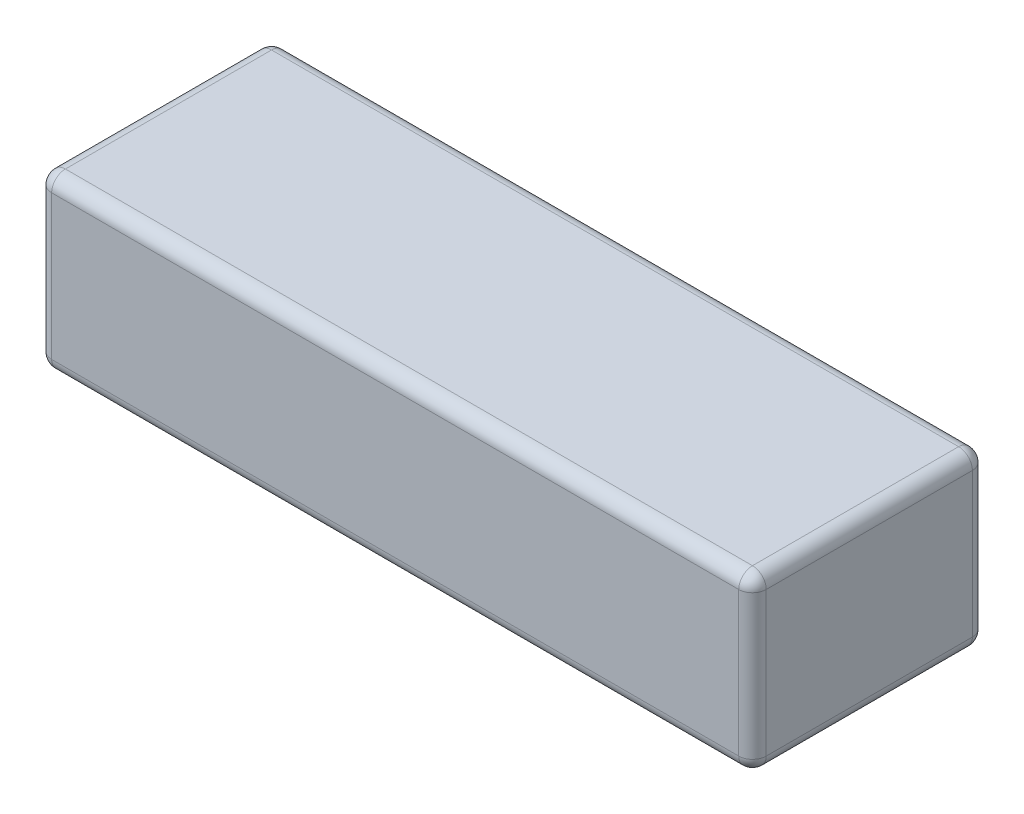
ISO-10303-21;
HEADER;
FILE_DESCRIPTION(('STEP AP214'),'2;1');
FILE_NAME('part.step','',(''),(''),'','','');
FILE_SCHEMA(('AUTOMOTIVE_DESIGN { 1 0 10303 214 1 1 1 1 }'));
ENDSEC;
DATA;
#1=APPLICATION_CONTEXT('core data for automotive mechanical design processes');
#2=APPLICATION_PROTOCOL_DEFINITION('international standard','automotive_design',2000,#1);
#3=PRODUCT_CONTEXT('',#1,'mechanical');
#4=PRODUCT('Part','Part','',(#3));
#5=PRODUCT_RELATED_PRODUCT_CATEGORY('part','',(#4));
#6=PRODUCT_DEFINITION_FORMATION('','',#4);
#7=PRODUCT_DEFINITION_CONTEXT('part definition',#1,'design');
#8=PRODUCT_DEFINITION('design','',#6,#7);
#9=PRODUCT_DEFINITION_SHAPE('','',#8);
#10=(LENGTH_UNIT() NAMED_UNIT(*) SI_UNIT(.MILLI.,.METRE.));
#11=(NAMED_UNIT(*) PLANE_ANGLE_UNIT() SI_UNIT($,.RADIAN.));
#12=(NAMED_UNIT(*) SI_UNIT($,.STERADIAN.) SOLID_ANGLE_UNIT());
#13=UNCERTAINTY_MEASURE_WITH_UNIT(LENGTH_MEASURE(1.E-05),#10,'distance_accuracy_value','');
#14=(GEOMETRIC_REPRESENTATION_CONTEXT(3) GLOBAL_UNCERTAINTY_ASSIGNED_CONTEXT((#13)) GLOBAL_UNIT_ASSIGNED_CONTEXT((#10,
#11,#12)) REPRESENTATION_CONTEXT('',''));
#15=CARTESIAN_POINT('',(0.,0.,0.));
#16=DIRECTION('',(0.,0.,1.));
#17=DIRECTION('',(1.,0.,0.));
#18=AXIS2_PLACEMENT_3D('',#15,#16,#17);
#19=CARTESIAN_POINT('',(52.,25.,17.));
#20=DIRECTION('',(-1.,0.,0.));
#21=DIRECTION('',(0.,0.,1.));
#22=AXIS2_PLACEMENT_3D('',#19,#20,#21);
#23=PLANE('',#22);
#24=DIRECTION('',(0.,-1.,0.));
#25=VECTOR('',#24,1.);
#26=CARTESIAN_POINT('',(52.,25.,-15.));
#27=LINE('',#26,#25);
#28=CARTESIAN_POINT('',(52.,2.,-15.));
#29=VERTEX_POINT('',#28);
#30=CARTESIAN_POINT('',(52.,23.,-15.));
#31=VERTEX_POINT('',#30);
#32=EDGE_CURVE('E132',#29,#31,#27,.F.);
#33=ORIENTED_EDGE('',*,*,#32,.T.);
#34=DIRECTION('',(0.,0.,-1.));
#35=VECTOR('',#34,1.);
#36=CARTESIAN_POINT('',(52.,23.,17.));
#37=LINE('',#36,#35);
#38=CARTESIAN_POINT('',(52.,23.,15.));
#39=VERTEX_POINT('',#38);
#40=EDGE_CURVE('E169',#31,#39,#37,.F.);
#41=ORIENTED_EDGE('',*,*,#40,.T.);
#42=DIRECTION('',(0.,-1.,0.));
#43=VECTOR('',#42,1.);
#44=CARTESIAN_POINT('',(52.,25.,15.));
#45=LINE('',#44,#43);
#46=CARTESIAN_POINT('',(52.,2.,15.));
#47=VERTEX_POINT('',#46);
#48=EDGE_CURVE('E166',#39,#47,#45,.T.);
#49=ORIENTED_EDGE('',*,*,#48,.T.);
#50=DIRECTION('',(0.,0.,-1.));
#51=VECTOR('',#50,1.);
#52=CARTESIAN_POINT('',(52.,2.,-17.));
#53=LINE('',#52,#51);
#54=EDGE_CURVE('E161',#47,#29,#53,.T.);
#55=ORIENTED_EDGE('',*,*,#54,.T.);
#56=EDGE_LOOP('',(#33,#41,#49,#55));
#57=FACE_BOUND('',#56,.T.);
#58=ADVANCED_FACE('F37',(#57),#23,.F.);
#59=CARTESIAN_POINT('',(-52.,25.,-17.));
#60=DIRECTION('',(0.,0.,1.));
#61=DIRECTION('',(1.,0.,0.));
#62=AXIS2_PLACEMENT_3D('',#59,#60,#61);
#63=PLANE('',#62);
#64=DIRECTION('',(0.,-1.,0.));
#65=VECTOR('',#64,1.);
#66=CARTESIAN_POINT('',(-50.,25.,-17.));
#67=LINE('',#66,#65);
#68=CARTESIAN_POINT('',(-50.,2.,-17.));
#69=VERTEX_POINT('',#68);
#70=CARTESIAN_POINT('',(-50.,23.,-17.));
#71=VERTEX_POINT('',#70);
#72=EDGE_CURVE('E154',#69,#71,#67,.F.);
#73=ORIENTED_EDGE('',*,*,#72,.T.);
#74=DIRECTION('',(-1.,0.,0.));
#75=VECTOR('',#74,1.);
#76=CARTESIAN_POINT('',(-52.,23.,-17.));
#77=LINE('',#76,#75);
#78=CARTESIAN_POINT('',(50.,23.,-17.));
#79=VERTEX_POINT('',#78);
#80=EDGE_CURVE('E158',#71,#79,#77,.F.);
#81=ORIENTED_EDGE('',*,*,#80,.T.);
#82=DIRECTION('',(0.,-1.,0.));
#83=VECTOR('',#82,1.);
#84=CARTESIAN_POINT('',(50.,25.,-17.));
#85=LINE('',#84,#83);
#86=CARTESIAN_POINT('',(50.,2.,-17.));
#87=VERTEX_POINT('',#86);
#88=EDGE_CURVE('E130',#79,#87,#85,.T.);
#89=ORIENTED_EDGE('',*,*,#88,.T.);
#90=DIRECTION('',(-1.,0.,0.));
#91=VECTOR('',#90,1.);
#92=CARTESIAN_POINT('',(-52.,2.,-17.));
#93=LINE('',#92,#91);
#94=EDGE_CURVE('E148',#87,#69,#93,.T.);
#95=ORIENTED_EDGE('',*,*,#94,.T.);
#96=EDGE_LOOP('',(#73,#81,#89,#95));
#97=FACE_BOUND('',#96,.T.);
#98=ADVANCED_FACE('F156',(#97),#63,.F.);
#99=CARTESIAN_POINT('',(-52.,25.,17.));
#100=DIRECTION('',(1.,0.,0.));
#101=DIRECTION('',(0.,0.,-1.));
#102=AXIS2_PLACEMENT_3D('',#99,#100,#101);
#103=PLANE('',#102);
#104=DIRECTION('',(0.,-1.,0.));
#105=VECTOR('',#104,1.);
#106=CARTESIAN_POINT('',(-52.,25.,15.));
#107=LINE('',#106,#105);
#108=CARTESIAN_POINT('',(-52.,2.,15.));
#109=VERTEX_POINT('',#108);
#110=CARTESIAN_POINT('',(-52.,23.,15.));
#111=VERTEX_POINT('',#110);
#112=EDGE_CURVE('E173',#109,#111,#107,.F.);
#113=ORIENTED_EDGE('',*,*,#112,.T.);
#114=DIRECTION('',(0.,0.,1.));
#115=VECTOR('',#114,1.);
#116=CARTESIAN_POINT('',(-52.,23.,17.));
#117=LINE('',#116,#115);
#118=CARTESIAN_POINT('',(-52.,23.,-15.));
#119=VERTEX_POINT('',#118);
#120=EDGE_CURVE('E178',#111,#119,#117,.F.);
#121=ORIENTED_EDGE('',*,*,#120,.T.);
#122=DIRECTION('',(0.,-1.,0.));
#123=VECTOR('',#122,1.);
#124=CARTESIAN_POINT('',(-52.,25.,-15.));
#125=LINE('',#124,#123);
#126=CARTESIAN_POINT('',(-52.,2.,-15.));
#127=VERTEX_POINT('',#126);
#128=EDGE_CURVE('E175',#119,#127,#125,.T.);
#129=ORIENTED_EDGE('',*,*,#128,.T.);
#130=DIRECTION('',(0.,0.,1.));
#131=VECTOR('',#130,1.);
#132=CARTESIAN_POINT('',(-52.,2.,17.));
#133=LINE('',#132,#131);
#134=EDGE_CURVE('E171',#127,#109,#133,.T.);
#135=ORIENTED_EDGE('',*,*,#134,.T.);
#136=EDGE_LOOP('',(#113,#121,#129,#135));
#137=FACE_BOUND('',#136,.T.);
#138=ADVANCED_FACE('F283',(#137),#103,.F.);
#139=CARTESIAN_POINT('',(-52.,25.,17.));
#140=DIRECTION('',(0.,0.,-1.));
#141=DIRECTION('',(-1.,0.,0.));
#142=AXIS2_PLACEMENT_3D('',#139,#140,#141);
#143=PLANE('',#142);
#144=DIRECTION('',(0.,-1.,0.));
#145=VECTOR('',#144,1.);
#146=CARTESIAN_POINT('',(50.,25.,17.));
#147=LINE('',#146,#145);
#148=CARTESIAN_POINT('',(50.,2.,17.));
#149=VERTEX_POINT('',#148);
#150=CARTESIAN_POINT('',(50.,23.,17.));
#151=VERTEX_POINT('',#150);
#152=EDGE_CURVE('E182',#149,#151,#147,.F.);
#153=ORIENTED_EDGE('',*,*,#152,.T.);
#154=DIRECTION('',(1.,0.,0.));
#155=VECTOR('',#154,1.);
#156=CARTESIAN_POINT('',(-52.,23.,17.));
#157=LINE('',#156,#155);
#158=CARTESIAN_POINT('',(-50.,23.,17.));
#159=VERTEX_POINT('',#158);
#160=EDGE_CURVE('E187',#151,#159,#157,.F.);
#161=ORIENTED_EDGE('',*,*,#160,.T.);
#162=DIRECTION('',(0.,-1.,0.));
#163=VECTOR('',#162,1.);
#164=CARTESIAN_POINT('',(-50.,25.,17.));
#165=LINE('',#164,#163);
#166=CARTESIAN_POINT('',(-50.,2.,17.));
#167=VERTEX_POINT('',#166);
#168=EDGE_CURVE('E184',#159,#167,#165,.T.);
#169=ORIENTED_EDGE('',*,*,#168,.T.);
#170=DIRECTION('',(1.,0.,0.));
#171=VECTOR('',#170,1.);
#172=CARTESIAN_POINT('',(52.,2.,17.));
#173=LINE('',#172,#171);
#174=EDGE_CURVE('E180',#167,#149,#173,.T.);
#175=ORIENTED_EDGE('',*,*,#174,.T.);
#176=EDGE_LOOP('',(#153,#161,#169,#175));
#177=FACE_BOUND('',#176,.T.);
#178=ADVANCED_FACE('F293',(#177),#143,.F.);
#179=CARTESIAN_POINT('',(0.,25.,0.));
#180=DIRECTION('',(0.,-1.,0.));
#181=DIRECTION('',(0.,0.,-1.));
#182=AXIS2_PLACEMENT_3D('',#179,#180,#181);
#183=PLANE('',#182);
#184=DIRECTION('',(0.,0.,1.));
#185=VECTOR('',#184,1.);
#186=CARTESIAN_POINT('',(-50.,25.,0.));
#187=LINE('',#186,#185);
#188=CARTESIAN_POINT('',(-50.,25.,-15.));
#189=VERTEX_POINT('',#188);
#190=CARTESIAN_POINT('',(-50.,25.,15.));
#191=VERTEX_POINT('',#190);
#192=EDGE_CURVE('E193',#189,#191,#187,.T.);
#193=ORIENTED_EDGE('',*,*,#192,.T.);
#194=DIRECTION('',(1.,0.,0.));
#195=VECTOR('',#194,1.);
#196=CARTESIAN_POINT('',(0.,25.,15.));
#197=LINE('',#196,#195);
#198=CARTESIAN_POINT('',(50.,25.,15.));
#199=VERTEX_POINT('',#198);
#200=EDGE_CURVE('E195',#191,#199,#197,.T.);
#201=ORIENTED_EDGE('',*,*,#200,.T.);
#202=DIRECTION('',(0.,0.,-1.));
#203=VECTOR('',#202,1.);
#204=CARTESIAN_POINT('',(50.,25.,0.));
#205=LINE('',#204,#203);
#206=CARTESIAN_POINT('',(50.,25.,-15.));
#207=VERTEX_POINT('',#206);
#208=EDGE_CURVE('E189',#199,#207,#205,.T.);
#209=ORIENTED_EDGE('',*,*,#208,.T.);
#210=DIRECTION('',(-1.,0.,0.));
#211=VECTOR('',#210,1.);
#212=CARTESIAN_POINT('',(0.,25.,-15.));
#213=LINE('',#212,#211);
#214=EDGE_CURVE('E191',#207,#189,#213,.T.);
#215=ORIENTED_EDGE('',*,*,#214,.T.);
#216=EDGE_LOOP('',(#193,#201,#209,#215));
#217=FACE_BOUND('',#216,.T.);
#218=ADVANCED_FACE('F275',(#217),#183,.F.);
#219=CARTESIAN_POINT('',(0.,0.,0.));
#220=DIRECTION('',(0.,-1.,0.));
#221=DIRECTION('',(0.,0.,-1.));
#222=AXIS2_PLACEMENT_3D('',#219,#220,#221);
#223=PLANE('',#222);
#224=DIRECTION('',(0.,0.,-1.));
#225=VECTOR('',#224,1.);
#226=CARTESIAN_POINT('',(50.,0.,17.));
#227=LINE('',#226,#225);
#228=CARTESIAN_POINT('',(50.,0.,-15.));
#229=VERTEX_POINT('',#228);
#230=CARTESIAN_POINT('',(50.,0.,15.));
#231=VERTEX_POINT('',#230);
#232=EDGE_CURVE('E198',#229,#231,#227,.F.);
#233=ORIENTED_EDGE('',*,*,#232,.T.);
#234=DIRECTION('',(1.,0.,0.));
#235=VECTOR('',#234,1.);
#236=CARTESIAN_POINT('',(-52.,0.,15.));
#237=LINE('',#236,#235);
#238=CARTESIAN_POINT('',(-50.,0.,15.));
#239=VERTEX_POINT('',#238);
#240=EDGE_CURVE('E11',#231,#239,#237,.F.);
#241=ORIENTED_EDGE('',*,*,#240,.T.);
#242=DIRECTION('',(0.,0.,1.));
#243=VECTOR('',#242,1.);
#244=CARTESIAN_POINT('',(-50.,0.,-17.));
#245=LINE('',#244,#243);
#246=CARTESIAN_POINT('',(-50.,0.,-15.));
#247=VERTEX_POINT('',#246);
#248=EDGE_CURVE('E46',#239,#247,#245,.F.);
#249=ORIENTED_EDGE('',*,*,#248,.T.);
#250=DIRECTION('',(-1.,0.,0.));
#251=VECTOR('',#250,1.);
#252=CARTESIAN_POINT('',(52.,0.,-15.));
#253=LINE('',#252,#251);
#254=EDGE_CURVE('E200',#247,#229,#253,.F.);
#255=ORIENTED_EDGE('',*,*,#254,.T.);
#256=EDGE_LOOP('',(#233,#241,#249,#255));
#257=FACE_BOUND('',#256,.T.);
#258=ADVANCED_FACE('F482',(#257),#223,.T.);
#259=CARTESIAN_POINT('',(-50.,25.,15.));
#260=DIRECTION('',(0.,-1.,0.));
#261=DIRECTION('',(0.,0.,-1.));
#262=AXIS2_PLACEMENT_3D('',#259,#260,#261);
#263=CYLINDRICAL_SURFACE('',#262,2.);
#264=CARTESIAN_POINT('',(-50.,23.,15.));
#265=DIRECTION('',(0.,1.,0.));
#266=DIRECTION('',(0.,0.,1.));
#267=AXIS2_PLACEMENT_3D('',#264,#265,#266);
#268=CIRCLE('',#267,2.);
#269=EDGE_CURVE('E41',#111,#159,#268,.T.);
#270=ORIENTED_EDGE('',*,*,#269,.F.);
#271=ORIENTED_EDGE('',*,*,#112,.F.);
#272=CARTESIAN_POINT('',(-50.,2.,15.));
#273=DIRECTION('',(0.,-1.,0.));
#274=DIRECTION('',(0.,0.,-1.));
#275=AXIS2_PLACEMENT_3D('',#272,#273,#274);
#276=CIRCLE('',#275,2.);
#277=EDGE_CURVE('E253',#167,#109,#276,.T.);
#278=ORIENTED_EDGE('',*,*,#277,.F.);
#279=ORIENTED_EDGE('',*,*,#168,.F.);
#280=EDGE_LOOP('',(#270,#271,#278,#279));
#281=FACE_BOUND('',#280,.T.);
#282=ADVANCED_FACE('F39',(#281),#263,.T.);
#283=CARTESIAN_POINT('',(-50.,23.,15.));
#284=DIRECTION('',(0.,0.,1.));
#285=DIRECTION('',(1.,0.,0.));
#286=AXIS2_PLACEMENT_3D('',#283,#284,#285);
#287=SPHERICAL_SURFACE('',#286,2.);
#288=CARTESIAN_POINT('',(-50.,23.,15.));
#289=DIRECTION('',(0.,0.,1.));
#290=DIRECTION('',(1.,0.,0.));
#291=AXIS2_PLACEMENT_3D('',#288,#289,#290);
#292=CIRCLE('',#291,2.);
#293=EDGE_CURVE('E248',#111,#191,#292,.F.);
#294=ORIENTED_EDGE('',*,*,#293,.F.);
#295=ORIENTED_EDGE('',*,*,#269,.T.);
#296=CARTESIAN_POINT('',(-50.,23.,15.));
#297=DIRECTION('',(-1.,0.,0.));
#298=DIRECTION('',(0.,0.,1.));
#299=AXIS2_PLACEMENT_3D('',#296,#297,#298);
#300=CIRCLE('',#299,2.);
#301=EDGE_CURVE('E251',#191,#159,#300,.F.);
#302=ORIENTED_EDGE('',*,*,#301,.F.);
#303=EDGE_LOOP('',(#294,#295,#302));
#304=FACE_BOUND('',#303,.T.);
#305=ADVANCED_FACE('F263',(#304),#287,.T.);
#306=CARTESIAN_POINT('',(-50.,2.,15.));
#307=DIRECTION('',(0.,0.,1.));
#308=DIRECTION('',(1.,0.,0.));
#309=AXIS2_PLACEMENT_3D('',#306,#307,#308);
#310=SPHERICAL_SURFACE('',#309,2.);
#311=CARTESIAN_POINT('',(-50.,2.,15.));
#312=DIRECTION('',(-1.,0.,0.));
#313=DIRECTION('',(0.,0.,1.));
#314=AXIS2_PLACEMENT_3D('',#311,#312,#313);
#315=CIRCLE('',#314,2.);
#316=EDGE_CURVE('E243',#167,#239,#315,.F.);
#317=ORIENTED_EDGE('',*,*,#316,.F.);
#318=ORIENTED_EDGE('',*,*,#277,.T.);
#319=CARTESIAN_POINT('',(-50.,2.,15.));
#320=DIRECTION('',(0.,0.,1.));
#321=DIRECTION('',(1.,0.,0.));
#322=AXIS2_PLACEMENT_3D('',#319,#320,#321);
#323=CIRCLE('',#322,2.);
#324=EDGE_CURVE('E246',#239,#109,#323,.F.);
#325=ORIENTED_EDGE('',*,*,#324,.F.);
#326=EDGE_LOOP('',(#317,#318,#325));
#327=FACE_BOUND('',#326,.T.);
#328=ADVANCED_FACE('F461',(#327),#310,.T.);
#329=CARTESIAN_POINT('',(0.,23.,15.));
#330=DIRECTION('',(1.,0.,0.));
#331=DIRECTION('',(0.,0.,-1.));
#332=AXIS2_PLACEMENT_3D('',#329,#330,#331);
#333=CYLINDRICAL_SURFACE('',#332,2.);
#334=ORIENTED_EDGE('',*,*,#301,.T.);
#335=ORIENTED_EDGE('',*,*,#160,.F.);
#336=CARTESIAN_POINT('',(50.,23.,15.));
#337=DIRECTION('',(1.,0.,0.));
#338=DIRECTION('',(0.,0.,-1.));
#339=AXIS2_PLACEMENT_3D('',#336,#337,#338);
#340=CIRCLE('',#339,2.);
#341=EDGE_CURVE('E237',#199,#151,#340,.T.);
#342=ORIENTED_EDGE('',*,*,#341,.F.);
#343=ORIENTED_EDGE('',*,*,#200,.F.);
#344=EDGE_LOOP('',(#334,#335,#342,#343));
#345=FACE_BOUND('',#344,.T.);
#346=ADVANCED_FACE('F271',(#345),#333,.T.);
#347=CARTESIAN_POINT('',(-50.,23.,0.));
#348=DIRECTION('',(0.,0.,1.));
#349=DIRECTION('',(1.,0.,0.));
#350=AXIS2_PLACEMENT_3D('',#347,#348,#349);
#351=CYLINDRICAL_SURFACE('',#350,2.);
#352=ORIENTED_EDGE('',*,*,#293,.T.);
#353=ORIENTED_EDGE('',*,*,#192,.F.);
#354=CARTESIAN_POINT('',(-50.,23.,-15.));
#355=DIRECTION('',(0.,0.,-1.));
#356=DIRECTION('',(0.,1.,0.));
#357=AXIS2_PLACEMENT_3D('',#354,#355,#356);
#358=CIRCLE('',#357,2.);
#359=EDGE_CURVE('E234',#119,#189,#358,.T.);
#360=ORIENTED_EDGE('',*,*,#359,.F.);
#361=ORIENTED_EDGE('',*,*,#120,.F.);
#362=EDGE_LOOP('',(#352,#353,#360,#361));
#363=FACE_BOUND('',#362,.T.);
#364=ADVANCED_FACE('F280',(#363),#351,.T.);
#365=CARTESIAN_POINT('',(-50.,25.,-15.));
#366=DIRECTION('',(0.,-1.,0.));
#367=DIRECTION('',(0.,0.,-1.));
#368=AXIS2_PLACEMENT_3D('',#365,#366,#367);
#369=CYLINDRICAL_SURFACE('',#368,2.);
#370=CARTESIAN_POINT('',(-50.,2.,-15.));
#371=DIRECTION('',(0.,-1.,0.));
#372=DIRECTION('',(0.,0.,-1.));
#373=AXIS2_PLACEMENT_3D('',#370,#371,#372);
#374=CIRCLE('',#373,2.);
#375=EDGE_CURVE('E228',#127,#69,#374,.T.);
#376=ORIENTED_EDGE('',*,*,#375,.F.);
#377=ORIENTED_EDGE('',*,*,#128,.F.);
#378=CARTESIAN_POINT('',(-50.,23.,-15.));
#379=DIRECTION('',(0.,1.,0.));
#380=DIRECTION('',(0.,0.,1.));
#381=AXIS2_PLACEMENT_3D('',#378,#379,#380);
#382=CIRCLE('',#381,2.);
#383=EDGE_CURVE('E231',#71,#119,#382,.T.);
#384=ORIENTED_EDGE('',*,*,#383,.F.);
#385=ORIENTED_EDGE('',*,*,#72,.F.);
#386=EDGE_LOOP('',(#376,#377,#384,#385));
#387=FACE_BOUND('',#386,.T.);
#388=ADVANCED_FACE('F287',(#387),#369,.T.);
#389=CARTESIAN_POINT('',(-50.,2.,17.));
#390=DIRECTION('',(0.,0.,-1.));
#391=DIRECTION('',(-1.,0.,0.));
#392=AXIS2_PLACEMENT_3D('',#389,#390,#391);
#393=CYLINDRICAL_SURFACE('',#392,2.);
#394=ORIENTED_EDGE('',*,*,#324,.T.);
#395=ORIENTED_EDGE('',*,*,#134,.F.);
#396=CARTESIAN_POINT('',(-50.,2.,-15.));
#397=DIRECTION('',(0.,0.,-1.));
#398=DIRECTION('',(-1.,0.,0.));
#399=AXIS2_PLACEMENT_3D('',#396,#397,#398);
#400=CIRCLE('',#399,2.);
#401=EDGE_CURVE('E226',#247,#127,#400,.T.);
#402=ORIENTED_EDGE('',*,*,#401,.F.);
#403=ORIENTED_EDGE('',*,*,#248,.F.);
#404=EDGE_LOOP('',(#394,#395,#402,#403));
#405=FACE_BOUND('',#404,.T.);
#406=ADVANCED_FACE('F291',(#405),#393,.T.);
#407=CARTESIAN_POINT('',(-52.,2.,15.));
#408=DIRECTION('',(-1.,0.,0.));
#409=DIRECTION('',(0.,0.,1.));
#410=AXIS2_PLACEMENT_3D('',#407,#408,#409);
#411=CYLINDRICAL_SURFACE('',#410,2.);
#412=ORIENTED_EDGE('',*,*,#316,.T.);
#413=ORIENTED_EDGE('',*,*,#240,.F.);
#414=CARTESIAN_POINT('',(50.,2.,15.));
#415=DIRECTION('',(1.,0.,0.));
#416=DIRECTION('',(0.,0.,-1.));
#417=AXIS2_PLACEMENT_3D('',#414,#415,#416);
#418=CIRCLE('',#417,2.);
#419=EDGE_CURVE('E223',#149,#231,#418,.T.);
#420=ORIENTED_EDGE('',*,*,#419,.F.);
#421=ORIENTED_EDGE('',*,*,#174,.F.);
#422=EDGE_LOOP('',(#412,#413,#420,#421));
#423=FACE_BOUND('',#422,.T.);
#424=ADVANCED_FACE('F303',(#423),#411,.T.);
#425=CARTESIAN_POINT('',(50.,25.,15.));
#426=DIRECTION('',(0.,-1.,0.));
#427=DIRECTION('',(0.,0.,-1.));
#428=AXIS2_PLACEMENT_3D('',#425,#426,#427);
#429=CYLINDRICAL_SURFACE('',#428,2.);
#430=CARTESIAN_POINT('',(50.,23.,15.));
#431=DIRECTION('',(0.,1.,0.));
#432=DIRECTION('',(0.,0.,1.));
#433=AXIS2_PLACEMENT_3D('',#430,#431,#432);
#434=CIRCLE('',#433,2.);
#435=EDGE_CURVE('E240',#151,#39,#434,.T.);
#436=ORIENTED_EDGE('',*,*,#435,.F.);
#437=ORIENTED_EDGE('',*,*,#152,.F.);
#438=CARTESIAN_POINT('',(50.,2.,15.));
#439=DIRECTION('',(0.,-1.,0.));
#440=DIRECTION('',(0.,0.,-1.));
#441=AXIS2_PLACEMENT_3D('',#438,#439,#440);
#442=CIRCLE('',#441,2.);
#443=EDGE_CURVE('E220',#47,#149,#442,.T.);
#444=ORIENTED_EDGE('',*,*,#443,.F.);
#445=ORIENTED_EDGE('',*,*,#48,.F.);
#446=EDGE_LOOP('',(#436,#437,#444,#445));
#447=FACE_BOUND('',#446,.T.);
#448=ADVANCED_FACE('F298',(#447),#429,.T.);
#449=CARTESIAN_POINT('',(50.,23.,15.));
#450=DIRECTION('',(0.,0.,1.));
#451=DIRECTION('',(1.,0.,0.));
#452=AXIS2_PLACEMENT_3D('',#449,#450,#451);
#453=SPHERICAL_SURFACE('',#452,2.);
#454=ORIENTED_EDGE('',*,*,#341,.T.);
#455=ORIENTED_EDGE('',*,*,#435,.T.);
#456=CARTESIAN_POINT('',(50.,23.,15.));
#457=DIRECTION('',(0.,0.,1.));
#458=DIRECTION('',(1.,0.,0.));
#459=AXIS2_PLACEMENT_3D('',#456,#457,#458);
#460=CIRCLE('',#459,2.);
#461=EDGE_CURVE('E217',#199,#39,#460,.F.);
#462=ORIENTED_EDGE('',*,*,#461,.F.);
#463=EDGE_LOOP('',(#454,#455,#462));
#464=FACE_BOUND('',#463,.T.);
#465=ADVANCED_FACE('F314',(#464),#453,.T.);
#466=CARTESIAN_POINT('',(-50.,23.,-15.));
#467=DIRECTION('',(0.,0.,1.));
#468=DIRECTION('',(1.,0.,0.));
#469=AXIS2_PLACEMENT_3D('',#466,#467,#468);
#470=SPHERICAL_SURFACE('',#469,2.);
#471=ORIENTED_EDGE('',*,*,#383,.T.);
#472=ORIENTED_EDGE('',*,*,#359,.T.);
#473=CARTESIAN_POINT('',(-50.,23.,-15.));
#474=DIRECTION('',(-1.,0.,0.));
#475=DIRECTION('',(0.,0.,1.));
#476=AXIS2_PLACEMENT_3D('',#473,#474,#475);
#477=CIRCLE('',#476,2.);
#478=EDGE_CURVE('E214',#71,#189,#477,.F.);
#479=ORIENTED_EDGE('',*,*,#478,.F.);
#480=EDGE_LOOP('',(#471,#472,#479));
#481=FACE_BOUND('',#480,.T.);
#482=ADVANCED_FACE('F324',(#481),#470,.T.);
#483=CARTESIAN_POINT('',(-50.,2.,-15.));
#484=DIRECTION('',(0.,0.,1.));
#485=DIRECTION('',(1.,0.,0.));
#486=AXIS2_PLACEMENT_3D('',#483,#484,#485);
#487=SPHERICAL_SURFACE('',#486,2.);
#488=ORIENTED_EDGE('',*,*,#401,.T.);
#489=ORIENTED_EDGE('',*,*,#375,.T.);
#490=CARTESIAN_POINT('',(-50.,2.,-15.));
#491=DIRECTION('',(-1.,0.,0.));
#492=DIRECTION('',(0.,0.,1.));
#493=AXIS2_PLACEMENT_3D('',#490,#491,#492);
#494=CIRCLE('',#493,2.);
#495=EDGE_CURVE('E151',#247,#69,#494,.F.);
#496=ORIENTED_EDGE('',*,*,#495,.F.);
#497=EDGE_LOOP('',(#488,#489,#496));
#498=FACE_BOUND('',#497,.T.);
#499=ADVANCED_FACE('F326',(#498),#487,.T.);
#500=CARTESIAN_POINT('',(50.,2.,15.));
#501=DIRECTION('',(0.,0.,1.));
#502=DIRECTION('',(1.,0.,0.));
#503=AXIS2_PLACEMENT_3D('',#500,#501,#502);
#504=SPHERICAL_SURFACE('',#503,2.);
#505=ORIENTED_EDGE('',*,*,#443,.T.);
#506=ORIENTED_EDGE('',*,*,#419,.T.);
#507=CARTESIAN_POINT('',(50.,2.,15.));
#508=DIRECTION('',(0.,0.,1.));
#509=DIRECTION('',(1.,0.,0.));
#510=AXIS2_PLACEMENT_3D('',#507,#508,#509);
#511=CIRCLE('',#510,2.);
#512=EDGE_CURVE('E210',#47,#231,#511,.F.);
#513=ORIENTED_EDGE('',*,*,#512,.F.);
#514=EDGE_LOOP('',(#505,#506,#513));
#515=FACE_BOUND('',#514,.T.);
#516=ADVANCED_FACE('F305',(#515),#504,.T.);
#517=CARTESIAN_POINT('',(50.,23.,0.));
#518=DIRECTION('',(0.,0.,-1.));
#519=DIRECTION('',(-1.,0.,0.));
#520=AXIS2_PLACEMENT_3D('',#517,#518,#519);
#521=CYLINDRICAL_SURFACE('',#520,2.);
#522=ORIENTED_EDGE('',*,*,#461,.T.);
#523=ORIENTED_EDGE('',*,*,#40,.F.);
#524=CARTESIAN_POINT('',(50.,23.,-15.));
#525=DIRECTION('',(0.,0.,-1.));
#526=DIRECTION('',(-1.,0.,0.));
#527=AXIS2_PLACEMENT_3D('',#524,#525,#526);
#528=CIRCLE('',#527,2.);
#529=EDGE_CURVE('E207',#207,#31,#528,.T.);
#530=ORIENTED_EDGE('',*,*,#529,.F.);
#531=ORIENTED_EDGE('',*,*,#208,.F.);
#532=EDGE_LOOP('',(#522,#523,#530,#531));
#533=FACE_BOUND('',#532,.T.);
#534=ADVANCED_FACE('F316',(#533),#521,.T.);
#535=CARTESIAN_POINT('',(0.,23.,-15.));
#536=DIRECTION('',(-1.,0.,0.));
#537=DIRECTION('',(0.,0.,1.));
#538=AXIS2_PLACEMENT_3D('',#535,#536,#537);
#539=CYLINDRICAL_SURFACE('',#538,2.);
#540=ORIENTED_EDGE('',*,*,#478,.T.);
#541=ORIENTED_EDGE('',*,*,#214,.F.);
#542=CARTESIAN_POINT('',(50.,23.,-15.));
#543=DIRECTION('',(1.,0.,0.));
#544=DIRECTION('',(0.,0.,-1.));
#545=AXIS2_PLACEMENT_3D('',#542,#543,#544);
#546=CIRCLE('',#545,2.);
#547=EDGE_CURVE('E145',#79,#207,#546,.T.);
#548=ORIENTED_EDGE('',*,*,#547,.F.);
#549=ORIENTED_EDGE('',*,*,#80,.F.);
#550=EDGE_LOOP('',(#540,#541,#548,#549));
#551=FACE_BOUND('',#550,.T.);
#552=ADVANCED_FACE('F322',(#551),#539,.T.);
#553=CARTESIAN_POINT('',(-52.,2.,-15.));
#554=DIRECTION('',(1.,0.,0.));
#555=DIRECTION('',(0.,0.,-1.));
#556=AXIS2_PLACEMENT_3D('',#553,#554,#555);
#557=CYLINDRICAL_SURFACE('',#556,2.);
#558=ORIENTED_EDGE('',*,*,#495,.T.);
#559=ORIENTED_EDGE('',*,*,#94,.F.);
#560=CARTESIAN_POINT('',(50.,2.,-15.));
#561=DIRECTION('',(1.,0.,0.));
#562=DIRECTION('',(0.,0.,-1.));
#563=AXIS2_PLACEMENT_3D('',#560,#561,#562);
#564=CIRCLE('',#563,2.);
#565=EDGE_CURVE('E138',#229,#87,#564,.T.);
#566=ORIENTED_EDGE('',*,*,#565,.F.);
#567=ORIENTED_EDGE('',*,*,#254,.F.);
#568=EDGE_LOOP('',(#558,#559,#566,#567));
#569=FACE_BOUND('',#568,.T.);
#570=ADVANCED_FACE('F149',(#569),#557,.T.);
#571=CARTESIAN_POINT('',(50.,2.,17.));
#572=DIRECTION('',(0.,0.,1.));
#573=DIRECTION('',(1.,0.,0.));
#574=AXIS2_PLACEMENT_3D('',#571,#572,#573);
#575=CYLINDRICAL_SURFACE('',#574,2.);
#576=ORIENTED_EDGE('',*,*,#512,.T.);
#577=ORIENTED_EDGE('',*,*,#232,.F.);
#578=CARTESIAN_POINT('',(50.,2.,-15.));
#579=DIRECTION('',(0.,0.,-1.));
#580=DIRECTION('',(-1.,0.,0.));
#581=AXIS2_PLACEMENT_3D('',#578,#579,#580);
#582=CIRCLE('',#581,2.);
#583=EDGE_CURVE('E142',#29,#229,#582,.T.);
#584=ORIENTED_EDGE('',*,*,#583,.F.);
#585=ORIENTED_EDGE('',*,*,#54,.F.);
#586=EDGE_LOOP('',(#576,#577,#584,#585));
#587=FACE_BOUND('',#586,.T.);
#588=ADVANCED_FACE('F309',(#587),#575,.T.);
#589=CARTESIAN_POINT('',(50.,23.,-15.));
#590=DIRECTION('',(0.,0.,1.));
#591=DIRECTION('',(1.,0.,0.));
#592=AXIS2_PLACEMENT_3D('',#589,#590,#591);
#593=SPHERICAL_SURFACE('',#592,2.);
#594=ORIENTED_EDGE('',*,*,#547,.T.);
#595=ORIENTED_EDGE('',*,*,#529,.T.);
#596=CARTESIAN_POINT('',(50.,23.,-15.));
#597=DIRECTION('',(0.,1.,0.));
#598=DIRECTION('',(0.,0.,1.));
#599=AXIS2_PLACEMENT_3D('',#596,#597,#598);
#600=CIRCLE('',#599,2.);
#601=EDGE_CURVE('E135',#79,#31,#600,.F.);
#602=ORIENTED_EDGE('',*,*,#601,.F.);
#603=EDGE_LOOP('',(#594,#595,#602));
#604=FACE_BOUND('',#603,.T.);
#605=ADVANCED_FACE('F320',(#604),#593,.T.);
#606=CARTESIAN_POINT('',(50.,2.,-15.));
#607=DIRECTION('',(0.,0.,1.));
#608=DIRECTION('',(1.,0.,0.));
#609=AXIS2_PLACEMENT_3D('',#606,#607,#608);
#610=SPHERICAL_SURFACE('',#609,2.);
#611=ORIENTED_EDGE('',*,*,#583,.T.);
#612=ORIENTED_EDGE('',*,*,#565,.T.);
#613=CARTESIAN_POINT('',(50.,2.,-15.));
#614=DIRECTION('',(0.,-1.,0.));
#615=DIRECTION('',(0.,0.,-1.));
#616=AXIS2_PLACEMENT_3D('',#613,#614,#615);
#617=CIRCLE('',#616,2.);
#618=EDGE_CURVE('E126',#29,#87,#617,.F.);
#619=ORIENTED_EDGE('',*,*,#618,.F.);
#620=EDGE_LOOP('',(#611,#612,#619));
#621=FACE_BOUND('',#620,.T.);
#622=ADVANCED_FACE('F140',(#621),#610,.T.);
#623=CARTESIAN_POINT('',(50.,25.,-15.));
#624=DIRECTION('',(0.,-1.,0.));
#625=DIRECTION('',(0.,0.,-1.));
#626=AXIS2_PLACEMENT_3D('',#623,#624,#625);
#627=CYLINDRICAL_SURFACE('',#626,2.);
#628=ORIENTED_EDGE('',*,*,#601,.T.);
#629=ORIENTED_EDGE('',*,*,#32,.F.);
#630=ORIENTED_EDGE('',*,*,#618,.T.);
#631=ORIENTED_EDGE('',*,*,#88,.F.);
#632=EDGE_LOOP('',(#628,#629,#630,#631));
#633=FACE_BOUND('',#632,.T.);
#634=ADVANCED_FACE('F128',(#633),#627,.T.);
#635=CLOSED_SHELL('',(#58,#98,#138,#178,#218,#258,#282,#305,#328,#346,#364,#388,#406,#424,#448,
#465,#482,#499,#516,#534,#552,#570,#588,#605,#622,#634));
#636=MANIFOLD_SOLID_BREP('B2',#635);
#637=ADVANCED_BREP_SHAPE_REPRESENTATION('',(#18,#636),#14);
#638=SHAPE_DEFINITION_REPRESENTATION(#9,#637);
ENDSEC;
END-ISO-10303-21;
